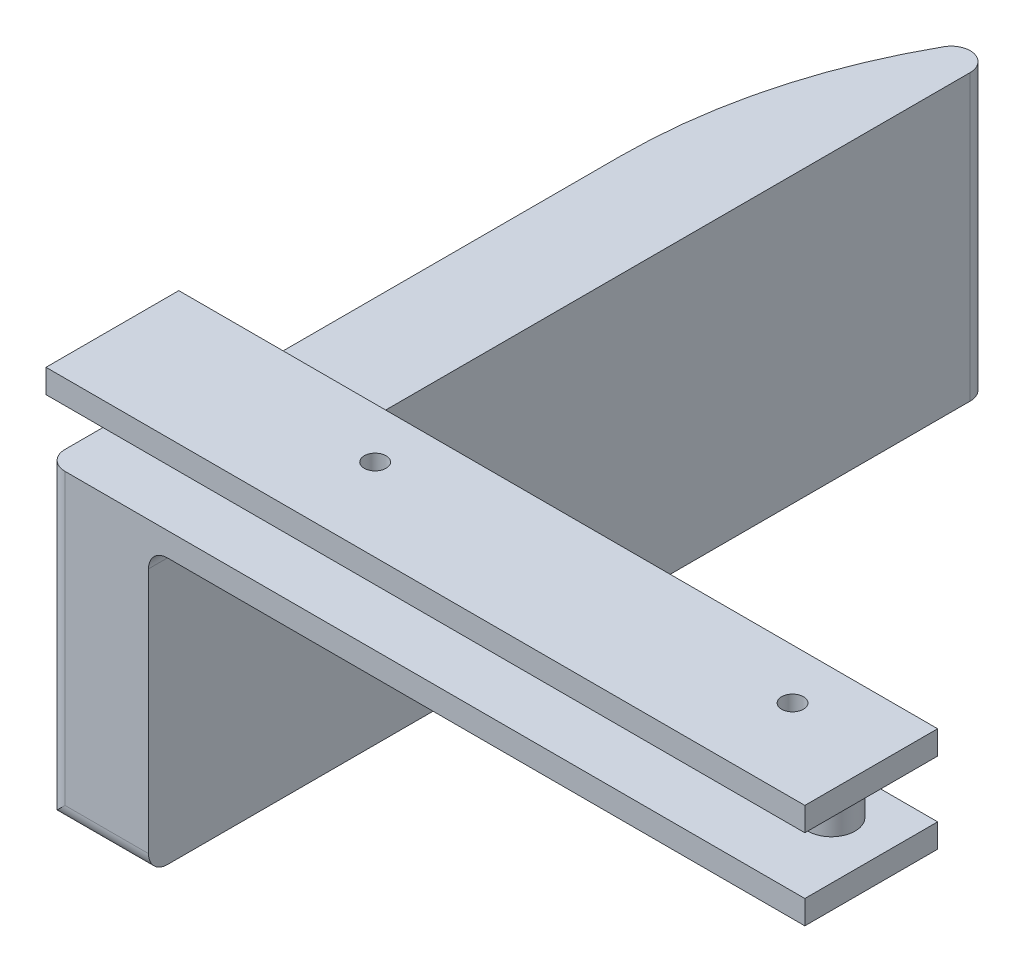
ISO-10303-21;
HEADER;
FILE_DESCRIPTION(('STEP AP214'),'2;1');
FILE_NAME('part.step','',(''),(''),'','','');
FILE_SCHEMA(('AUTOMOTIVE_DESIGN { 1 0 10303 214 1 1 1 1 }'));
ENDSEC;
DATA;
#1=APPLICATION_CONTEXT('core data for automotive mechanical design processes');
#2=APPLICATION_PROTOCOL_DEFINITION('international standard','automotive_design',2000,#1);
#3=PRODUCT_CONTEXT('',#1,'mechanical');
#4=PRODUCT('Part','Part','',(#3));
#5=PRODUCT_RELATED_PRODUCT_CATEGORY('part','',(#4));
#6=PRODUCT_DEFINITION_FORMATION('','',#4);
#7=PRODUCT_DEFINITION_CONTEXT('part definition',#1,'design');
#8=PRODUCT_DEFINITION('design','',#6,#7);
#9=PRODUCT_DEFINITION_SHAPE('','',#8);
#10=(LENGTH_UNIT() NAMED_UNIT(*) SI_UNIT(.MILLI.,.METRE.));
#11=(NAMED_UNIT(*) PLANE_ANGLE_UNIT() SI_UNIT($,.RADIAN.));
#12=(NAMED_UNIT(*) SI_UNIT($,.STERADIAN.) SOLID_ANGLE_UNIT());
#13=UNCERTAINTY_MEASURE_WITH_UNIT(LENGTH_MEASURE(1.E-05),#10,'distance_accuracy_value','');
#14=(GEOMETRIC_REPRESENTATION_CONTEXT(3) GLOBAL_UNCERTAINTY_ASSIGNED_CONTEXT((#13)) GLOBAL_UNIT_ASSIGNED_CONTEXT((#10,
#11,#12)) REPRESENTATION_CONTEXT('',''));
#15=CARTESIAN_POINT('',(0.,0.,0.));
#16=DIRECTION('',(0.,0.,1.));
#17=DIRECTION('',(1.,0.,0.));
#18=AXIS2_PLACEMENT_3D('',#15,#16,#17);
#19=CARTESIAN_POINT('',(0.,-10.795,0.));
#20=DIRECTION('',(0.,1.,0.));
#21=DIRECTION('',(0.,0.,-1.));
#22=AXIS2_PLACEMENT_3D('',#19,#20,#21);
#23=PLANE('',#22);
#24=CARTESIAN_POINT('',(88.9,-10.795,-11.049));
#25=DIRECTION('',(0.,1.,0.));
#26=DIRECTION('',(0.,0.,1.));
#27=AXIS2_PLACEMENT_3D('',#24,#25,#26);
#28=CIRCLE('',#27,1.4605);
#29=CARTESIAN_POINT('',(88.9,-10.795,-9.5885));
#30=VERTEX_POINT('',#29);
#31=EDGE_CURVE('E348',#30,#30,#28,.T.);
#32=ORIENTED_EDGE('',*,*,#31,.T.);
#33=EDGE_LOOP('',(#32));
#34=FACE_BOUND('',#33,.T.);
#35=CARTESIAN_POINT('',(33.02,-10.795,-11.049));
#36=DIRECTION('',(0.,1.,0.));
#37=DIRECTION('',(0.,0.,1.));
#38=AXIS2_PLACEMENT_3D('',#35,#36,#37);
#39=CIRCLE('',#38,1.46050000000001);
#40=CARTESIAN_POINT('',(33.02,-10.795,-9.58849999999999));
#41=VERTEX_POINT('',#40);
#42=EDGE_CURVE('E351',#41,#41,#39,.T.);
#43=ORIENTED_EDGE('',*,*,#42,.T.);
#44=EDGE_LOOP('',(#43));
#45=FACE_BOUND('',#44,.T.);
#46=DIRECTION('',(1.,0.,0.));
#47=VECTOR('',#46,1.);
#48=CARTESIAN_POINT('',(0.,-10.795,0.));
#49=LINE('',#48,#47);
#50=CARTESIAN_POINT('',(16.2644477837442,-10.795,0.));
#51=VERTEX_POINT('',#50);
#52=CARTESIAN_POINT('',(101.6,-10.795,0.));
#53=VERTEX_POINT('',#52);
#54=EDGE_CURVE('E213',#51,#53,#49,.T.);
#55=ORIENTED_EDGE('',*,*,#54,.F.);
#56=DIRECTION('',(0.,0.,1.));
#57=VECTOR('',#56,1.);
#58=CARTESIAN_POINT('',(16.2644477837442,-10.795,-17.78));
#59=LINE('',#58,#57);
#60=CARTESIAN_POINT('',(16.2644477837442,-10.795,-17.78));
#61=VERTEX_POINT('',#60);
#62=EDGE_CURVE('E56',#51,#61,#59,.F.);
#63=ORIENTED_EDGE('',*,*,#62,.T.);
#64=DIRECTION('',(-1.,0.,0.));
#65=VECTOR('',#64,1.);
#66=CARTESIAN_POINT('',(0.,-10.795,-17.78));
#67=LINE('',#66,#65);
#68=CARTESIAN_POINT('',(101.6,-10.795,-17.78));
#69=VERTEX_POINT('',#68);
#70=EDGE_CURVE('E207',#69,#61,#67,.T.);
#71=ORIENTED_EDGE('',*,*,#70,.F.);
#72=DIRECTION('',(0.,0.,-1.));
#73=VECTOR('',#72,1.);
#74=CARTESIAN_POINT('',(101.6,-10.795,0.));
#75=LINE('',#74,#73);
#76=EDGE_CURVE('E209',#53,#69,#75,.T.);
#77=ORIENTED_EDGE('',*,*,#76,.F.);
#78=EDGE_LOOP('',(#55,#63,#71,#77));
#79=FACE_BOUND('',#78,.T.);
#80=ADVANCED_FACE('F33',(#34,#45,#79),#23,.F.);
#81=CARTESIAN_POINT('',(0.,3.175,0.));
#82=DIRECTION('',(1.,0.,0.));
#83=DIRECTION('',(0.,0.,-1.));
#84=AXIS2_PLACEMENT_3D('',#81,#82,#83);
#85=PLANE('',#84);
#86=DIRECTION('',(0.,0.,1.));
#87=VECTOR('',#86,1.);
#88=CARTESIAN_POINT('',(0.,0.,0.));
#89=LINE('',#88,#87);
#90=CARTESIAN_POINT('',(0.,0.,-17.78));
#91=VERTEX_POINT('',#90);
#92=CARTESIAN_POINT('',(0.,0.,0.));
#93=VERTEX_POINT('',#92);
#94=EDGE_CURVE('E261',#91,#93,#89,.T.);
#95=ORIENTED_EDGE('',*,*,#94,.T.);
#96=DIRECTION('',(0.,-1.,0.));
#97=VECTOR('',#96,1.);
#98=CARTESIAN_POINT('',(0.,3.175,0.));
#99=LINE('',#98,#97);
#100=CARTESIAN_POINT('',(0.,3.175,0.));
#101=VERTEX_POINT('',#100);
#102=EDGE_CURVE('E288',#101,#93,#99,.T.);
#103=ORIENTED_EDGE('',*,*,#102,.F.);
#104=DIRECTION('',(0.,0.,1.));
#105=VECTOR('',#104,1.);
#106=CARTESIAN_POINT('',(0.,3.175,0.));
#107=LINE('',#106,#105);
#108=CARTESIAN_POINT('',(0.,3.175,-17.78));
#109=VERTEX_POINT('',#108);
#110=EDGE_CURVE('E262',#109,#101,#107,.T.);
#111=ORIENTED_EDGE('',*,*,#110,.F.);
#112=DIRECTION('',(0.,-1.,0.));
#113=VECTOR('',#112,1.);
#114=CARTESIAN_POINT('',(0.,3.175,-17.78));
#115=LINE('',#114,#113);
#116=EDGE_CURVE('E272',#109,#91,#115,.T.);
#117=ORIENTED_EDGE('',*,*,#116,.T.);
#118=EDGE_LOOP('',(#95,#103,#111,#117));
#119=FACE_BOUND('',#118,.T.);
#120=ADVANCED_FACE('F373',(#119),#85,.F.);
#121=CARTESIAN_POINT('',(0.,3.175,0.));
#122=DIRECTION('',(0.,0.,-1.));
#123=DIRECTION('',(-1.,0.,0.));
#124=AXIS2_PLACEMENT_3D('',#121,#122,#123);
#125=PLANE('',#124);
#126=DIRECTION('',(1.,0.,0.));
#127=VECTOR('',#126,1.);
#128=CARTESIAN_POINT('',(0.,0.,0.));
#129=LINE('',#128,#127);
#130=CARTESIAN_POINT('',(101.6,0.,0.));
#131=VERTEX_POINT('',#130);
#132=EDGE_CURVE('E275',#93,#131,#129,.T.);
#133=ORIENTED_EDGE('',*,*,#132,.T.);
#134=DIRECTION('',(0.,-1.,0.));
#135=VECTOR('',#134,1.);
#136=CARTESIAN_POINT('',(101.6,3.175,0.));
#137=LINE('',#136,#135);
#138=CARTESIAN_POINT('',(101.6,3.175,0.));
#139=VERTEX_POINT('',#138);
#140=EDGE_CURVE('E285',#139,#131,#137,.T.);
#141=ORIENTED_EDGE('',*,*,#140,.F.);
#142=DIRECTION('',(1.,0.,0.));
#143=VECTOR('',#142,1.);
#144=CARTESIAN_POINT('',(0.,3.175,0.));
#145=LINE('',#144,#143);
#146=EDGE_CURVE('E265',#101,#139,#145,.T.);
#147=ORIENTED_EDGE('',*,*,#146,.F.);
#148=ORIENTED_EDGE('',*,*,#102,.T.);
#149=EDGE_LOOP('',(#133,#141,#147,#148));
#150=FACE_BOUND('',#149,.T.);
#151=ADVANCED_FACE('F378',(#150),#125,.F.);
#152=CARTESIAN_POINT('',(101.6,3.175,0.));
#153=DIRECTION('',(-1.,0.,0.));
#154=DIRECTION('',(0.,0.,1.));
#155=AXIS2_PLACEMENT_3D('',#152,#153,#154);
#156=PLANE('',#155);
#157=DIRECTION('',(0.,0.,-1.));
#158=VECTOR('',#157,1.);
#159=CARTESIAN_POINT('',(101.6,0.,0.));
#160=LINE('',#159,#158);
#161=CARTESIAN_POINT('',(101.6,0.,-17.78));
#162=VERTEX_POINT('',#161);
#163=EDGE_CURVE('E277',#131,#162,#160,.T.);
#164=ORIENTED_EDGE('',*,*,#163,.T.);
#165=DIRECTION('',(0.,-1.,0.));
#166=VECTOR('',#165,1.);
#167=CARTESIAN_POINT('',(101.6,3.175,-17.78));
#168=LINE('',#167,#166);
#169=CARTESIAN_POINT('',(101.6,3.175,-17.78));
#170=VERTEX_POINT('',#169);
#171=EDGE_CURVE('E282',#170,#162,#168,.T.);
#172=ORIENTED_EDGE('',*,*,#171,.F.);
#173=DIRECTION('',(0.,0.,-1.));
#174=VECTOR('',#173,1.);
#175=CARTESIAN_POINT('',(101.6,3.175,0.));
#176=LINE('',#175,#174);
#177=EDGE_CURVE('E268',#139,#170,#176,.T.);
#178=ORIENTED_EDGE('',*,*,#177,.F.);
#179=ORIENTED_EDGE('',*,*,#140,.T.);
#180=EDGE_LOOP('',(#164,#172,#178,#179));
#181=FACE_BOUND('',#180,.T.);
#182=ADVANCED_FACE('F423',(#181),#156,.F.);
#183=CARTESIAN_POINT('',(0.,3.175,-17.78));
#184=DIRECTION('',(0.,0.,1.));
#185=DIRECTION('',(1.,0.,0.));
#186=AXIS2_PLACEMENT_3D('',#183,#184,#185);
#187=PLANE('',#186);
#188=DIRECTION('',(-1.,0.,0.));
#189=VECTOR('',#188,1.);
#190=CARTESIAN_POINT('',(0.,0.,-17.78));
#191=LINE('',#190,#189);
#192=EDGE_CURVE('E266',#162,#91,#191,.T.);
#193=ORIENTED_EDGE('',*,*,#192,.T.);
#194=ORIENTED_EDGE('',*,*,#116,.F.);
#195=DIRECTION('',(-1.,0.,0.));
#196=VECTOR('',#195,1.);
#197=CARTESIAN_POINT('',(0.,3.175,-17.78));
#198=LINE('',#197,#196);
#199=EDGE_CURVE('E270',#170,#109,#198,.T.);
#200=ORIENTED_EDGE('',*,*,#199,.F.);
#201=ORIENTED_EDGE('',*,*,#171,.T.);
#202=EDGE_LOOP('',(#193,#194,#200,#201));
#203=FACE_BOUND('',#202,.T.);
#204=ADVANCED_FACE('F416',(#203),#187,.F.);
#205=CARTESIAN_POINT('',(0.,3.175,0.));
#206=DIRECTION('',(0.,-1.,0.));
#207=DIRECTION('',(0.,0.,-1.));
#208=AXIS2_PLACEMENT_3D('',#205,#206,#207);
#209=PLANE('',#208);
#210=CARTESIAN_POINT('',(88.9,3.175,-11.049));
#211=DIRECTION('',(0.,1.,0.));
#212=DIRECTION('',(0.,0.,1.));
#213=AXIS2_PLACEMENT_3D('',#210,#211,#212);
#214=CIRCLE('',#213,1.4605);
#215=CARTESIAN_POINT('',(88.9,3.175,-9.5885));
#216=VERTEX_POINT('',#215);
#217=EDGE_CURVE('E356',#216,#216,#214,.T.);
#218=ORIENTED_EDGE('',*,*,#217,.F.);
#219=EDGE_LOOP('',(#218));
#220=FACE_BOUND('',#219,.T.);
#221=CARTESIAN_POINT('',(33.02,3.175,-11.049));
#222=DIRECTION('',(0.,1.,0.));
#223=DIRECTION('',(0.,0.,1.));
#224=AXIS2_PLACEMENT_3D('',#221,#222,#223);
#225=CIRCLE('',#224,1.46050000000001);
#226=CARTESIAN_POINT('',(33.02,3.175,-9.58849999999999));
#227=VERTEX_POINT('',#226);
#228=EDGE_CURVE('E570',#227,#227,#225,.T.);
#229=ORIENTED_EDGE('',*,*,#228,.F.);
#230=EDGE_LOOP('',(#229));
#231=FACE_BOUND('',#230,.T.);
#232=ORIENTED_EDGE('',*,*,#110,.T.);
#233=ORIENTED_EDGE('',*,*,#146,.T.);
#234=ORIENTED_EDGE('',*,*,#177,.T.);
#235=ORIENTED_EDGE('',*,*,#199,.T.);
#236=EDGE_LOOP('',(#232,#233,#234,#235));
#237=FACE_BOUND('',#236,.T.);
#238=ADVANCED_FACE('F413',(#220,#231,#237),#209,.F.);
#239=CARTESIAN_POINT('',(0.,0.,0.));
#240=DIRECTION('',(0.,-1.,0.));
#241=DIRECTION('',(0.,0.,-1.));
#242=AXIS2_PLACEMENT_3D('',#239,#240,#241);
#243=PLANE('',#242);
#244=CARTESIAN_POINT('',(93.98,0.,-11.176));
#245=DIRECTION('',(0.,-1.,0.));
#246=DIRECTION('',(0.,0.,-1.));
#247=AXIS2_PLACEMENT_3D('',#244,#245,#246);
#248=CIRCLE('',#247,3.175);
#249=CARTESIAN_POINT('',(93.98,0.,-14.351));
#250=VERTEX_POINT('',#249);
#251=CARTESIAN_POINT('',(93.98,0.,-8.00099999999999));
#252=VERTEX_POINT('',#251);
#253=EDGE_CURVE('E229',#250,#252,#248,.T.);
#254=ORIENTED_EDGE('',*,*,#253,.F.);
#255=DIRECTION('',(-1.,0.,0.));
#256=VECTOR('',#255,1.);
#257=CARTESIAN_POINT('',(93.98,0.,-14.351));
#258=LINE('',#257,#256);
#259=CARTESIAN_POINT('',(5.08,0.,-14.351));
#260=VERTEX_POINT('',#259);
#261=EDGE_CURVE('E233',#250,#260,#258,.T.);
#262=ORIENTED_EDGE('',*,*,#261,.T.);
#263=CARTESIAN_POINT('',(5.08,0.,-11.176));
#264=DIRECTION('',(0.,-1.,0.));
#265=DIRECTION('',(0.,0.,-1.));
#266=AXIS2_PLACEMENT_3D('',#263,#264,#265);
#267=CIRCLE('',#266,3.175);
#268=CARTESIAN_POINT('',(5.08,0.,-8.001));
#269=VERTEX_POINT('',#268);
#270=EDGE_CURVE('E246',#269,#260,#267,.T.);
#271=ORIENTED_EDGE('',*,*,#270,.F.);
#272=DIRECTION('',(-1.,0.,0.));
#273=VECTOR('',#272,1.);
#274=CARTESIAN_POINT('',(93.98,0.,-8.00099999999999));
#275=LINE('',#274,#273);
#276=EDGE_CURVE('E243',#252,#269,#275,.T.);
#277=ORIENTED_EDGE('',*,*,#276,.F.);
#278=EDGE_LOOP('',(#254,#262,#271,#277));
#279=FACE_BOUND('',#278,.T.);
#280=ORIENTED_EDGE('',*,*,#94,.F.);
#281=ORIENTED_EDGE('',*,*,#192,.F.);
#282=ORIENTED_EDGE('',*,*,#163,.F.);
#283=ORIENTED_EDGE('',*,*,#132,.F.);
#284=EDGE_LOOP('',(#280,#281,#282,#283));
#285=FACE_BOUND('',#284,.T.);
#286=ADVANCED_FACE('F411',(#279,#285),#243,.T.);
#287=CARTESIAN_POINT('',(93.98,-7.62,-11.176));
#288=DIRECTION('',(0.,1.,0.));
#289=DIRECTION('',(0.,0.,1.));
#290=AXIS2_PLACEMENT_3D('',#287,#288,#289);
#291=CYLINDRICAL_SURFACE('',#290,3.175);
#292=ORIENTED_EDGE('',*,*,#253,.T.);
#293=DIRECTION('',(0.,1.,0.));
#294=VECTOR('',#293,1.);
#295=CARTESIAN_POINT('',(93.98,-7.62,-8.00099999999999));
#296=LINE('',#295,#294);
#297=CARTESIAN_POINT('',(93.98,-7.62,-8.00099999999999));
#298=VERTEX_POINT('',#297);
#299=EDGE_CURVE('E258',#298,#252,#296,.T.);
#300=ORIENTED_EDGE('',*,*,#299,.F.);
#301=CARTESIAN_POINT('',(93.98,-7.62,-11.176));
#302=DIRECTION('',(0.,-1.,0.));
#303=DIRECTION('',(0.,0.,-1.));
#304=AXIS2_PLACEMENT_3D('',#301,#302,#303);
#305=CIRCLE('',#304,3.175);
#306=CARTESIAN_POINT('',(93.98,-7.62,-14.351));
#307=VERTEX_POINT('',#306);
#308=EDGE_CURVE('E230',#307,#298,#305,.T.);
#309=ORIENTED_EDGE('',*,*,#308,.F.);
#310=DIRECTION('',(0.,1.,0.));
#311=VECTOR('',#310,1.);
#312=CARTESIAN_POINT('',(93.98,-7.62,-14.351));
#313=LINE('',#312,#311);
#314=EDGE_CURVE('E240',#307,#250,#313,.T.);
#315=ORIENTED_EDGE('',*,*,#314,.T.);
#316=EDGE_LOOP('',(#292,#300,#309,#315));
#317=FACE_BOUND('',#316,.T.);
#318=ADVANCED_FACE('F407',(#317),#291,.T.);
#319=CARTESIAN_POINT('',(93.98,-7.62,-8.00099999999999));
#320=DIRECTION('',(0.,0.,-1.));
#321=DIRECTION('',(-1.,0.,0.));
#322=AXIS2_PLACEMENT_3D('',#319,#320,#321);
#323=PLANE('',#322);
#324=ORIENTED_EDGE('',*,*,#276,.T.);
#325=DIRECTION('',(0.,1.,0.));
#326=VECTOR('',#325,1.);
#327=CARTESIAN_POINT('',(5.08,-7.62,-8.001));
#328=LINE('',#327,#326);
#329=CARTESIAN_POINT('',(5.08,-7.62,-8.001));
#330=VERTEX_POINT('',#329);
#331=EDGE_CURVE('E255',#330,#269,#328,.T.);
#332=ORIENTED_EDGE('',*,*,#331,.F.);
#333=DIRECTION('',(-1.,0.,0.));
#334=VECTOR('',#333,1.);
#335=CARTESIAN_POINT('',(93.98,-7.62,-8.00099999999999));
#336=LINE('',#335,#334);
#337=EDGE_CURVE('E232',#298,#330,#336,.T.);
#338=ORIENTED_EDGE('',*,*,#337,.F.);
#339=ORIENTED_EDGE('',*,*,#299,.T.);
#340=EDGE_LOOP('',(#324,#332,#338,#339));
#341=FACE_BOUND('',#340,.T.);
#342=ADVANCED_FACE('F403',(#341),#323,.F.);
#343=CARTESIAN_POINT('',(5.08,-7.62,-11.176));
#344=DIRECTION('',(0.,1.,0.));
#345=DIRECTION('',(0.,0.,1.));
#346=AXIS2_PLACEMENT_3D('',#343,#344,#345);
#347=CYLINDRICAL_SURFACE('',#346,3.175);
#348=ORIENTED_EDGE('',*,*,#270,.T.);
#349=DIRECTION('',(0.,1.,0.));
#350=VECTOR('',#349,1.);
#351=CARTESIAN_POINT('',(5.08,-7.62,-14.351));
#352=LINE('',#351,#350);
#353=CARTESIAN_POINT('',(5.08,-7.62,-14.351));
#354=VERTEX_POINT('',#353);
#355=EDGE_CURVE('E252',#354,#260,#352,.T.);
#356=ORIENTED_EDGE('',*,*,#355,.F.);
#357=CARTESIAN_POINT('',(5.08,-7.62,-11.176));
#358=DIRECTION('',(0.,-1.,0.));
#359=DIRECTION('',(0.,0.,-1.));
#360=AXIS2_PLACEMENT_3D('',#357,#358,#359);
#361=CIRCLE('',#360,3.175);
#362=EDGE_CURVE('E235',#330,#354,#361,.T.);
#363=ORIENTED_EDGE('',*,*,#362,.F.);
#364=ORIENTED_EDGE('',*,*,#331,.T.);
#365=EDGE_LOOP('',(#348,#356,#363,#364));
#366=FACE_BOUND('',#365,.T.);
#367=ADVANCED_FACE('F399',(#366),#347,.T.);
#368=CARTESIAN_POINT('',(93.98,-7.62,-14.351));
#369=DIRECTION('',(0.,0.,-1.));
#370=DIRECTION('',(-1.,0.,0.));
#371=AXIS2_PLACEMENT_3D('',#368,#369,#370);
#372=PLANE('',#371);
#373=ORIENTED_EDGE('',*,*,#261,.F.);
#374=ORIENTED_EDGE('',*,*,#314,.F.);
#375=DIRECTION('',(-1.,0.,0.));
#376=VECTOR('',#375,1.);
#377=CARTESIAN_POINT('',(93.98,-7.62,-14.351));
#378=LINE('',#377,#376);
#379=EDGE_CURVE('E237',#307,#354,#378,.T.);
#380=ORIENTED_EDGE('',*,*,#379,.T.);
#381=ORIENTED_EDGE('',*,*,#355,.T.);
#382=EDGE_LOOP('',(#373,#374,#380,#381));
#383=FACE_BOUND('',#382,.T.);
#384=ADVANCED_FACE('F396',(#383),#372,.T.);
#385=CARTESIAN_POINT('',(0.,-10.795,0.));
#386=DIRECTION('',(-1.,0.,0.));
#387=DIRECTION('',(0.,0.,1.));
#388=AXIS2_PLACEMENT_3D('',#385,#386,#387);
#389=PLANE('',#388);
#390=DIRECTION('',(0.,0.,-1.));
#391=VECTOR('',#390,1.);
#392=CARTESIAN_POINT('',(0.,-48.895,0.));
#393=LINE('',#392,#391);
#394=CARTESIAN_POINT('',(0.,-48.895,-2.54));
#395=VERTEX_POINT('',#394);
#396=CARTESIAN_POINT('',(0.,-48.895,-76.9173177660465));
#397=VERTEX_POINT('',#396);
#398=EDGE_CURVE('E169',#395,#397,#393,.T.);
#399=ORIENTED_EDGE('',*,*,#398,.F.);
#400=DIRECTION('',(0.,1.,0.));
#401=VECTOR('',#400,1.);
#402=CARTESIAN_POINT('',(0.,-10.795,-2.54));
#403=LINE('',#402,#401);
#404=CARTESIAN_POINT('',(0.,-7.62,-2.54));
#405=VERTEX_POINT('',#404);
#406=EDGE_CURVE('E299',#395,#405,#403,.T.);
#407=ORIENTED_EDGE('',*,*,#406,.T.);
#408=DIRECTION('',(0.,0.,1.));
#409=VECTOR('',#408,1.);
#410=CARTESIAN_POINT('',(0.,-7.62,0.));
#411=LINE('',#410,#409);
#412=CARTESIAN_POINT('',(0.,-7.62,-17.78));
#413=VERTEX_POINT('',#412);
#414=EDGE_CURVE('E197',#413,#405,#411,.T.);
#415=ORIENTED_EDGE('',*,*,#414,.F.);
#416=DIRECTION('',(0.,1.,0.));
#417=VECTOR('',#416,1.);
#418=CARTESIAN_POINT('',(0.,-10.795,-17.78));
#419=LINE('',#418,#417);
#420=CARTESIAN_POINT('',(0.,-10.795,-17.78));
#421=VERTEX_POINT('',#420);
#422=EDGE_CURVE('E227',#421,#413,#419,.T.);
#423=ORIENTED_EDGE('',*,*,#422,.F.);
#424=DIRECTION('',(0.,0.,-1.));
#425=VECTOR('',#424,1.);
#426=CARTESIAN_POINT('',(0.,-10.795,0.));
#427=LINE('',#426,#425);
#428=CARTESIAN_POINT('',(0.,-10.795,-76.9173177660465));
#429=VERTEX_POINT('',#428);
#430=EDGE_CURVE('E195',#421,#429,#427,.T.);
#431=ORIENTED_EDGE('',*,*,#430,.T.);
#432=DIRECTION('',(0.,1.,0.));
#433=VECTOR('',#432,1.);
#434=CARTESIAN_POINT('',(0.,-48.895,-76.9173177660465));
#435=LINE('',#434,#433);
#436=EDGE_CURVE('E187',#397,#429,#435,.T.);
#437=ORIENTED_EDGE('',*,*,#436,.F.);
#438=EDGE_LOOP('',(#399,#407,#415,#423,#431,#437));
#439=FACE_BOUND('',#438,.T.);
#440=ADVANCED_FACE('F192',(#439),#389,.T.);
#441=CARTESIAN_POINT('',(0.,-10.795,-17.78));
#442=DIRECTION('',(0.,0.,-1.));
#443=DIRECTION('',(-1.,0.,0.));
#444=AXIS2_PLACEMENT_3D('',#441,#442,#443);
#445=PLANE('',#444);
#446=DIRECTION('',(-1.,0.,0.));
#447=VECTOR('',#446,1.);
#448=CARTESIAN_POINT('',(0.,-7.62,-17.78));
#449=LINE('',#448,#447);
#450=CARTESIAN_POINT('',(101.6,-7.62,-17.78));
#451=VERTEX_POINT('',#450);
#452=EDGE_CURVE('E201',#451,#413,#449,.T.);
#453=ORIENTED_EDGE('',*,*,#452,.F.);
#454=DIRECTION('',(0.,1.,0.));
#455=VECTOR('',#454,1.);
#456=CARTESIAN_POINT('',(101.6,-10.795,-17.78));
#457=LINE('',#456,#455);
#458=EDGE_CURVE('E225',#69,#451,#457,.T.);
#459=ORIENTED_EDGE('',*,*,#458,.F.);
#460=ORIENTED_EDGE('',*,*,#70,.T.);
#461=CARTESIAN_POINT('',(16.2644477837442,-13.335,-17.78));
#462=DIRECTION('',(0.,0.,-1.));
#463=DIRECTION('',(-1.,0.,0.));
#464=AXIS2_PLACEMENT_3D('',#461,#462,#463);
#465=CIRCLE('',#464,2.54);
#466=CARTESIAN_POINT('',(13.7244477837442,-13.335,-17.78));
#467=VERTEX_POINT('',#466);
#468=EDGE_CURVE('E11',#61,#467,#465,.F.);
#469=ORIENTED_EDGE('',*,*,#468,.T.);
#470=DIRECTION('',(0.,-1.,0.));
#471=VECTOR('',#470,1.);
#472=CARTESIAN_POINT('',(13.7244477837442,-48.895,-17.78));
#473=LINE('',#472,#471);
#474=CARTESIAN_POINT('',(13.7244477837442,-10.795,-17.78));
#475=VERTEX_POINT('',#474);
#476=EDGE_CURVE('E48',#475,#467,#473,.T.);
#477=ORIENTED_EDGE('',*,*,#476,.F.);
#478=EDGE_CURVE('E210',#475,#421,#67,.T.);
#479=ORIENTED_EDGE('',*,*,#478,.T.);
#480=ORIENTED_EDGE('',*,*,#422,.T.);
#481=EDGE_LOOP('',(#453,#459,#460,#469,#477,#479,#480));
#482=FACE_BOUND('',#481,.T.);
#483=ADVANCED_FACE('F325',(#482),#445,.T.);
#484=CARTESIAN_POINT('',(101.6,-10.795,0.));
#485=DIRECTION('',(1.,0.,0.));
#486=DIRECTION('',(0.,0.,-1.));
#487=AXIS2_PLACEMENT_3D('',#484,#485,#486);
#488=PLANE('',#487);
#489=DIRECTION('',(0.,0.,-1.));
#490=VECTOR('',#489,1.);
#491=CARTESIAN_POINT('',(101.6,-7.62,0.));
#492=LINE('',#491,#490);
#493=CARTESIAN_POINT('',(101.6,-7.62,0.));
#494=VERTEX_POINT('',#493);
#495=EDGE_CURVE('E218',#494,#451,#492,.T.);
#496=ORIENTED_EDGE('',*,*,#495,.F.);
#497=DIRECTION('',(0.,1.,0.));
#498=VECTOR('',#497,1.);
#499=CARTESIAN_POINT('',(101.6,-10.795,0.));
#500=LINE('',#499,#498);
#501=EDGE_CURVE('E214',#53,#494,#500,.T.);
#502=ORIENTED_EDGE('',*,*,#501,.F.);
#503=ORIENTED_EDGE('',*,*,#76,.T.);
#504=ORIENTED_EDGE('',*,*,#458,.T.);
#505=EDGE_LOOP('',(#496,#502,#503,#504));
#506=FACE_BOUND('',#505,.T.);
#507=ADVANCED_FACE('F341',(#506),#488,.T.);
#508=CARTESIAN_POINT('',(0.,-10.795,0.));
#509=DIRECTION('',(0.,0.,1.));
#510=DIRECTION('',(1.,0.,0.));
#511=AXIS2_PLACEMENT_3D('',#508,#509,#510);
#512=PLANE('',#511);
#513=DIRECTION('',(1.,0.,0.));
#514=VECTOR('',#513,1.);
#515=CARTESIAN_POINT('',(0.,-7.62,0.));
#516=LINE('',#515,#514);
#517=CARTESIAN_POINT('',(2.54,-7.62,0.));
#518=VERTEX_POINT('',#517);
#519=EDGE_CURVE('E221',#518,#494,#516,.T.);
#520=ORIENTED_EDGE('',*,*,#519,.F.);
#521=DIRECTION('',(0.,1.,0.));
#522=VECTOR('',#521,1.);
#523=CARTESIAN_POINT('',(2.54,-10.795,0.));
#524=LINE('',#523,#522);
#525=CARTESIAN_POINT('',(2.54,-46.355,0.));
#526=VERTEX_POINT('',#525);
#527=EDGE_CURVE('E305',#518,#526,#524,.F.);
#528=ORIENTED_EDGE('',*,*,#527,.T.);
#529=DIRECTION('',(-1.,0.,0.));
#530=VECTOR('',#529,1.);
#531=CARTESIAN_POINT('',(0.,-46.355,0.));
#532=LINE('',#531,#530);
#533=CARTESIAN_POINT('',(13.7244477837442,-46.355,0.));
#534=VERTEX_POINT('',#533);
#535=EDGE_CURVE('E303',#526,#534,#532,.F.);
#536=ORIENTED_EDGE('',*,*,#535,.T.);
#537=DIRECTION('',(0.,1.,0.));
#538=VECTOR('',#537,1.);
#539=CARTESIAN_POINT('',(13.7244477837442,-48.895,0.));
#540=LINE('',#539,#538);
#541=CARTESIAN_POINT('',(13.7244477837442,-13.335,0.));
#542=VERTEX_POINT('',#541);
#543=EDGE_CURVE('E198',#534,#542,#540,.T.);
#544=ORIENTED_EDGE('',*,*,#543,.T.);
#545=CARTESIAN_POINT('',(16.2644477837442,-13.335,0.));
#546=DIRECTION('',(0.,0.,1.));
#547=DIRECTION('',(1.,0.,0.));
#548=AXIS2_PLACEMENT_3D('',#545,#546,#547);
#549=CIRCLE('',#548,2.54);
#550=EDGE_CURVE('E42',#542,#51,#549,.F.);
#551=ORIENTED_EDGE('',*,*,#550,.T.);
#552=ORIENTED_EDGE('',*,*,#54,.T.);
#553=ORIENTED_EDGE('',*,*,#501,.T.);
#554=EDGE_LOOP('',(#520,#528,#536,#544,#551,#552,#553));
#555=FACE_BOUND('',#554,.T.);
#556=ADVANCED_FACE('F317',(#555),#512,.T.);
#557=CARTESIAN_POINT('',(0.,-7.62,0.));
#558=DIRECTION('',(0.,1.,0.));
#559=DIRECTION('',(0.,0.,-1.));
#560=AXIS2_PLACEMENT_3D('',#557,#558,#559);
#561=PLANE('',#560);
#562=ORIENTED_EDGE('',*,*,#379,.F.);
#563=ORIENTED_EDGE('',*,*,#308,.T.);
#564=ORIENTED_EDGE('',*,*,#337,.T.);
#565=ORIENTED_EDGE('',*,*,#362,.T.);
#566=EDGE_LOOP('',(#562,#563,#564,#565));
#567=FACE_BOUND('',#566,.T.);
#568=ORIENTED_EDGE('',*,*,#414,.T.);
#569=CARTESIAN_POINT('',(2.54,-7.62,-2.54));
#570=DIRECTION('',(0.,1.,0.));
#571=DIRECTION('',(0.,0.,1.));
#572=AXIS2_PLACEMENT_3D('',#569,#570,#571);
#573=CIRCLE('',#572,2.54);
#574=EDGE_CURVE('E301',#405,#518,#573,.T.);
#575=ORIENTED_EDGE('',*,*,#574,.T.);
#576=ORIENTED_EDGE('',*,*,#519,.T.);
#577=ORIENTED_EDGE('',*,*,#495,.T.);
#578=ORIENTED_EDGE('',*,*,#452,.T.);
#579=EDGE_LOOP('',(#568,#575,#576,#577,#578));
#580=FACE_BOUND('',#579,.T.);
#581=ADVANCED_FACE('F338',(#567,#580),#561,.T.);
#582=CARTESIAN_POINT('',(70.2143866228511,-48.895,-76.9173177660465));
#583=DIRECTION('',(0.,1.,0.));
#584=DIRECTION('',(0.,0.,1.));
#585=AXIS2_PLACEMENT_3D('',#582,#583,#584);
#586=CYLINDRICAL_SURFACE('',#585,70.2143866228511);
#587=CARTESIAN_POINT('',(70.2143866228511,-10.795,-76.9173177660465));
#588=DIRECTION('',(0.,-1.,0.));
#589=DIRECTION('',(0.,0.,-1.));
#590=AXIS2_PLACEMENT_3D('',#587,#588,#589);
#591=CIRCLE('',#590,70.2143866228511);
#592=CARTESIAN_POINT('',(8.96889693602206,-10.795,-111.254616463581));
#593=VERTEX_POINT('',#592);
#594=EDGE_CURVE('E333',#429,#593,#591,.T.);
#595=ORIENTED_EDGE('',*,*,#594,.T.);
#596=DIRECTION('',(0.,1.,0.));
#597=VECTOR('',#596,1.);
#598=CARTESIAN_POINT('',(8.96889693602206,-48.895,-111.254616463581));
#599=LINE('',#598,#597);
#600=CARTESIAN_POINT('',(8.96889693602206,-48.895,-111.254616463581));
#601=VERTEX_POINT('',#600);
#602=EDGE_CURVE('E189',#593,#601,#599,.F.);
#603=ORIENTED_EDGE('',*,*,#602,.T.);
#604=CARTESIAN_POINT('',(70.2143866228511,-48.895,-76.9173177660465));
#605=DIRECTION('',(0.,-1.,0.));
#606=DIRECTION('',(0.,0.,-1.));
#607=AXIS2_PLACEMENT_3D('',#604,#605,#606);
#608=CIRCLE('',#607,70.2143866228511);
#609=EDGE_CURVE('E173',#397,#601,#608,.T.);
#610=ORIENTED_EDGE('',*,*,#609,.F.);
#611=ORIENTED_EDGE('',*,*,#436,.T.);
#612=EDGE_LOOP('',(#595,#603,#610,#611));
#613=FACE_BOUND('',#612,.T.);
#614=ADVANCED_FACE('F186',(#613),#586,.T.);
#615=CARTESIAN_POINT('',(13.7244477837442,-48.895,0.));
#616=DIRECTION('',(-1.,0.,0.));
#617=DIRECTION('',(0.,0.,1.));
#618=AXIS2_PLACEMENT_3D('',#615,#616,#617);
#619=PLANE('',#618);
#620=ORIENTED_EDGE('',*,*,#543,.F.);
#621=CARTESIAN_POINT('',(13.7244477837442,-46.355,-2.54));
#622=DIRECTION('',(-1.,0.,0.));
#623=DIRECTION('',(0.,0.,1.));
#624=AXIS2_PLACEMENT_3D('',#621,#622,#623);
#625=CIRCLE('',#624,2.54);
#626=CARTESIAN_POINT('',(13.7244477837442,-48.895,-2.54));
#627=VERTEX_POINT('',#626);
#628=EDGE_CURVE('E312',#534,#627,#625,.F.);
#629=ORIENTED_EDGE('',*,*,#628,.T.);
#630=DIRECTION('',(0.,0.,1.));
#631=VECTOR('',#630,1.);
#632=CARTESIAN_POINT('',(13.7244477837442,-48.895,0.));
#633=LINE('',#632,#631);
#634=CARTESIAN_POINT('',(13.7244477837442,-48.895,-110.012467341633));
#635=VERTEX_POINT('',#634);
#636=EDGE_CURVE('E190',#635,#627,#633,.T.);
#637=ORIENTED_EDGE('',*,*,#636,.F.);
#638=DIRECTION('',(0.,1.,0.));
#639=VECTOR('',#638,1.);
#640=CARTESIAN_POINT('',(13.7244477837442,-48.895,-110.012467341633));
#641=LINE('',#640,#639);
#642=CARTESIAN_POINT('',(13.7244477837442,-10.795,-110.012467341633));
#643=VERTEX_POINT('',#642);
#644=EDGE_CURVE('E291',#635,#643,#641,.T.);
#645=ORIENTED_EDGE('',*,*,#644,.T.);
#646=DIRECTION('',(0.,0.,1.));
#647=VECTOR('',#646,1.);
#648=CARTESIAN_POINT('',(13.7244477837442,-10.795,0.));
#649=LINE('',#648,#647);
#650=EDGE_CURVE('E181',#643,#475,#649,.T.);
#651=ORIENTED_EDGE('',*,*,#650,.T.);
#652=ORIENTED_EDGE('',*,*,#476,.T.);
#653=DIRECTION('',(0.,0.,1.));
#654=VECTOR('',#653,1.);
#655=CARTESIAN_POINT('',(13.7244477837442,-13.335,0.));
#656=LINE('',#655,#654);
#657=EDGE_CURVE('E309',#467,#542,#656,.T.);
#658=ORIENTED_EDGE('',*,*,#657,.T.);
#659=EDGE_LOOP('',(#620,#629,#637,#645,#651,#652,#658));
#660=FACE_BOUND('',#659,.T.);
#661=ADVANCED_FACE('F327',(#660),#619,.F.);
#662=CARTESIAN_POINT('',(70.2143866228511,-48.895,-76.9173177660465));
#663=DIRECTION('',(0.,-1.,0.));
#664=DIRECTION('',(0.,0.,-1.));
#665=AXIS2_PLACEMENT_3D('',#662,#663,#664);
#666=PLANE('',#665);
#667=ORIENTED_EDGE('',*,*,#636,.T.);
#668=DIRECTION('',(-1.,0.,0.));
#669=VECTOR('',#668,1.);
#670=CARTESIAN_POINT('',(70.2143866228511,-48.895,-2.54));
#671=LINE('',#670,#669);
#672=EDGE_CURVE('E176',#627,#395,#671,.T.);
#673=ORIENTED_EDGE('',*,*,#672,.T.);
#674=ORIENTED_EDGE('',*,*,#398,.T.);
#675=ORIENTED_EDGE('',*,*,#609,.T.);
#676=CARTESIAN_POINT('',(11.1844477837442,-48.895,-110.012467341633));
#677=DIRECTION('',(0.,-1.,0.));
#678=DIRECTION('',(0.,0.,-1.));
#679=AXIS2_PLACEMENT_3D('',#676,#677,#678);
#680=CIRCLE('',#679,2.54);
#681=EDGE_CURVE('E297',#601,#635,#680,.T.);
#682=ORIENTED_EDGE('',*,*,#681,.T.);
#683=EDGE_LOOP('',(#667,#673,#674,#675,#682));
#684=FACE_BOUND('',#683,.T.);
#685=ADVANCED_FACE('F172',(#684),#666,.T.);
#686=CARTESIAN_POINT('',(70.2143866228511,-10.795,-76.9173177660465));
#687=DIRECTION('',(0.,-1.,0.));
#688=DIRECTION('',(0.,0.,-1.));
#689=AXIS2_PLACEMENT_3D('',#686,#687,#688);
#690=PLANE('',#689);
#691=ORIENTED_EDGE('',*,*,#650,.F.);
#692=CARTESIAN_POINT('',(11.1844477837442,-10.795,-110.012467341633));
#693=DIRECTION('',(0.,-1.,0.));
#694=DIRECTION('',(0.,0.,-1.));
#695=AXIS2_PLACEMENT_3D('',#692,#693,#694);
#696=CIRCLE('',#695,2.54);
#697=EDGE_CURVE('E294',#643,#593,#696,.F.);
#698=ORIENTED_EDGE('',*,*,#697,.T.);
#699=ORIENTED_EDGE('',*,*,#594,.F.);
#700=ORIENTED_EDGE('',*,*,#430,.F.);
#701=ORIENTED_EDGE('',*,*,#478,.F.);
#702=EDGE_LOOP('',(#691,#698,#699,#700,#701));
#703=FACE_BOUND('',#702,.T.);
#704=ADVANCED_FACE('F334',(#703),#690,.F.);
#705=CARTESIAN_POINT('',(11.1844477837442,-48.895,-110.012467341633));
#706=DIRECTION('',(0.,1.,0.));
#707=DIRECTION('',(0.,0.,1.));
#708=AXIS2_PLACEMENT_3D('',#705,#706,#707);
#709=CYLINDRICAL_SURFACE('',#708,2.54);
#710=ORIENTED_EDGE('',*,*,#681,.F.);
#711=ORIENTED_EDGE('',*,*,#602,.F.);
#712=ORIENTED_EDGE('',*,*,#697,.F.);
#713=ORIENTED_EDGE('',*,*,#644,.F.);
#714=EDGE_LOOP('',(#710,#711,#712,#713));
#715=FACE_BOUND('',#714,.T.);
#716=ADVANCED_FACE('F362',(#715),#709,.T.);
#717=CARTESIAN_POINT('',(70.2143866228511,-46.355,-2.54));
#718=DIRECTION('',(-1.,0.,0.));
#719=DIRECTION('',(0.,0.,1.));
#720=AXIS2_PLACEMENT_3D('',#717,#718,#719);
#721=CYLINDRICAL_SURFACE('',#720,2.54);
#722=ORIENTED_EDGE('',*,*,#628,.F.);
#723=ORIENTED_EDGE('',*,*,#535,.F.);
#724=CARTESIAN_POINT('',(2.54,-46.355,-2.54));
#725=DIRECTION('',(-0.707106781186547,0.707106781186547,0.));
#726=DIRECTION('',(-0.707106781186547,-0.707106781186547,0.));
#727=AXIS2_PLACEMENT_3D('',#724,#725,#726);
#728=ELLIPSE('',#727,3.59210244842766,2.54);
#729=EDGE_CURVE('E37',#395,#526,#728,.T.);
#730=ORIENTED_EDGE('',*,*,#729,.F.);
#731=ORIENTED_EDGE('',*,*,#672,.F.);
#732=EDGE_LOOP('',(#722,#723,#730,#731));
#733=FACE_BOUND('',#732,.T.);
#734=ADVANCED_FACE('F364',(#733),#721,.T.);
#735=CARTESIAN_POINT('',(2.54,-10.795,-2.54));
#736=DIRECTION('',(0.,1.,0.));
#737=DIRECTION('',(0.,0.,1.));
#738=AXIS2_PLACEMENT_3D('',#735,#736,#737);
#739=CYLINDRICAL_SURFACE('',#738,2.54);
#740=ORIENTED_EDGE('',*,*,#729,.T.);
#741=ORIENTED_EDGE('',*,*,#527,.F.);
#742=ORIENTED_EDGE('',*,*,#574,.F.);
#743=ORIENTED_EDGE('',*,*,#406,.F.);
#744=EDGE_LOOP('',(#740,#741,#742,#743));
#745=FACE_BOUND('',#744,.T.);
#746=ADVANCED_FACE('F346',(#745),#739,.T.);
#747=CARTESIAN_POINT('',(16.2644477837442,-13.335,0.));
#748=DIRECTION('',(0.,0.,-1.));
#749=DIRECTION('',(-1.,0.,0.));
#750=AXIS2_PLACEMENT_3D('',#747,#748,#749);
#751=CYLINDRICAL_SURFACE('',#750,2.54);
#752=ORIENTED_EDGE('',*,*,#468,.F.);
#753=ORIENTED_EDGE('',*,*,#62,.F.);
#754=ORIENTED_EDGE('',*,*,#550,.F.);
#755=ORIENTED_EDGE('',*,*,#657,.F.);
#756=EDGE_LOOP('',(#752,#753,#754,#755));
#757=FACE_BOUND('',#756,.T.);
#758=ADVANCED_FACE('F35',(#757),#751,.F.);
#759=CARTESIAN_POINT('',(33.02,-48.895,-11.049));
#760=DIRECTION('',(0.,1.,0.));
#761=DIRECTION('',(0.,0.,1.));
#762=AXIS2_PLACEMENT_3D('',#759,#760,#761);
#763=CYLINDRICAL_SURFACE('',#762,1.46050000000001);
#764=CARTESIAN_POINT('',(33.02,3.175,-9.58849999999999));
#765=CARTESIAN_POINT('',(33.02,3.02947916666666,-9.58849999999999));
#766=CARTESIAN_POINT('',(33.02,2.88395833333333,-9.58849999999999));
#767=CARTESIAN_POINT('',(33.02,2.59291666666666,-9.58849999999999));
#768=CARTESIAN_POINT('',(33.02,2.44739583333333,-9.58849999999999));
#769=CARTESIAN_POINT('',(33.02,2.15635416666666,-9.58849999999999));
#770=CARTESIAN_POINT('',(33.02,2.01083333333333,-9.58849999999999));
#771=CARTESIAN_POINT('',(33.02,1.71979166666667,-9.58849999999999));
#772=CARTESIAN_POINT('',(33.02,1.57427083333333,-9.58849999999999));
#773=CARTESIAN_POINT('',(33.02,1.28322916666667,-9.58849999999999));
#774=CARTESIAN_POINT('',(33.02,1.13770833333333,-9.58849999999999));
#775=CARTESIAN_POINT('',(33.02,0.846666666666665,-9.58849999999999));
#776=CARTESIAN_POINT('',(33.02,0.701145833333331,-9.58849999999999));
#777=CARTESIAN_POINT('',(33.02,0.410104166666663,-9.58849999999999));
#778=CARTESIAN_POINT('',(33.02,0.26458333333333,-9.58849999999999));
#779=CARTESIAN_POINT('',(33.02,-0.0264583333333355,-9.58849999999999));
#780=CARTESIAN_POINT('',(33.02,-0.171979166666667,-9.58849999999999));
#781=CARTESIAN_POINT('',(33.02,-0.463020833333332,-9.58849999999999));
#782=CARTESIAN_POINT('',(33.02,-0.608541666666666,-9.58849999999999));
#783=CARTESIAN_POINT('',(33.02,-0.899583333333333,-9.58849999999999));
#784=CARTESIAN_POINT('',(33.02,-1.04510416666667,-9.58849999999999));
#785=CARTESIAN_POINT('',(33.02,-1.33614583333333,-9.58849999999999));
#786=CARTESIAN_POINT('',(33.02,-1.48166666666667,-9.58849999999999));
#787=CARTESIAN_POINT('',(33.02,-1.77270833333334,-9.58849999999999));
#788=CARTESIAN_POINT('',(33.02,-1.91822916666667,-9.58849999999999));
#789=CARTESIAN_POINT('',(33.02,-2.20927083333334,-9.58849999999999));
#790=CARTESIAN_POINT('',(33.02,-2.35479166666667,-9.58849999999999));
#791=CARTESIAN_POINT('',(33.02,-2.64583333333334,-9.58849999999999));
#792=CARTESIAN_POINT('',(33.02,-2.79135416666667,-9.58849999999999));
#793=CARTESIAN_POINT('',(33.02,-3.08239583333333,-9.58849999999999));
#794=CARTESIAN_POINT('',(33.02,-3.22791666666667,-9.58849999999999));
#795=CARTESIAN_POINT('',(33.02,-3.51895833333333,-9.58849999999999));
#796=CARTESIAN_POINT('',(33.02,-3.66447916666667,-9.58849999999999));
#797=CARTESIAN_POINT('',(33.02,-3.95552083333333,-9.58849999999999));
#798=CARTESIAN_POINT('',(33.02,-4.10104166666667,-9.58849999999999));
#799=CARTESIAN_POINT('',(33.02,-4.39208333333333,-9.58849999999999));
#800=CARTESIAN_POINT('',(33.02,-4.53760416666666,-9.58849999999999));
#801=CARTESIAN_POINT('',(33.02,-4.82864583333333,-9.58849999999999));
#802=CARTESIAN_POINT('',(33.02,-4.97416666666666,-9.58849999999999));
#803=CARTESIAN_POINT('',(33.02,-5.26520833333333,-9.58849999999999));
#804=CARTESIAN_POINT('',(33.02,-5.41072916666667,-9.58849999999999));
#805=CARTESIAN_POINT('',(33.02,-5.70177083333333,-9.58849999999999));
#806=CARTESIAN_POINT('',(33.02,-5.84729166666667,-9.58849999999999));
#807=CARTESIAN_POINT('',(33.02,-6.13833333333333,-9.58849999999999));
#808=CARTESIAN_POINT('',(33.02,-6.28385416666667,-9.58849999999999));
#809=CARTESIAN_POINT('',(33.02,-6.57489583333333,-9.58849999999999));
#810=CARTESIAN_POINT('',(33.02,-6.72041666666667,-9.58849999999999));
#811=CARTESIAN_POINT('',(33.02,-7.01145833333334,-9.58849999999999));
#812=CARTESIAN_POINT('',(33.02,-7.15697916666667,-9.58849999999999));
#813=CARTESIAN_POINT('',(33.02,-7.44802083333334,-9.58849999999999));
#814=CARTESIAN_POINT('',(33.02,-7.59354166666667,-9.58849999999999));
#815=CARTESIAN_POINT('',(33.02,-7.88458333333333,-9.58849999999999));
#816=CARTESIAN_POINT('',(33.02,-8.03010416666666,-9.58849999999999));
#817=CARTESIAN_POINT('',(33.02,-8.32114583333333,-9.58849999999999));
#818=CARTESIAN_POINT('',(33.02,-8.46666666666667,-9.58849999999999));
#819=CARTESIAN_POINT('',(33.02,-8.75770833333334,-9.58849999999999));
#820=CARTESIAN_POINT('',(33.02,-8.90322916666667,-9.58849999999999));
#821=CARTESIAN_POINT('',(33.02,-9.19427083333333,-9.58849999999999));
#822=CARTESIAN_POINT('',(33.02,-9.33979166666666,-9.58849999999999));
#823=CARTESIAN_POINT('',(33.02,-9.63083333333333,-9.58849999999999));
#824=CARTESIAN_POINT('',(33.02,-9.77635416666666,-9.58849999999999));
#825=CARTESIAN_POINT('',(33.02,-10.0673958333333,-9.58849999999999));
#826=CARTESIAN_POINT('',(33.02,-10.2129166666667,-9.58849999999999));
#827=CARTESIAN_POINT('',(33.02,-10.5039583333333,-9.58849999999999));
#828=CARTESIAN_POINT('',(33.02,-10.6494791666667,-9.58849999999999));
#829=CARTESIAN_POINT('',(33.02,-10.795,-9.58849999999999));
#830=B_SPLINE_CURVE_WITH_KNOTS('',3,(#764,#765,#766,#767,#768,#769,#770,#771,#772,#773,#774,
#775,#776,#777,#778,#779,#780,#781,#782,#783,#784,#785,#786,#787,#788,#789,#790,#791,#792,#793,
#794,#795,#796,#797,#798,#799,#800,#801,#802,#803,#804,#805,#806,#807,#808,#809,#810,#811,#812,
#813,#814,#815,#816,#817,#818,#819,#820,#821,#822,#823,#824,#825,#826,#827,#828,#829),
.UNSPECIFIED.,.F.,.F.,(4,2,2,2,2,2,2,2,2,2,2,2,2,2,2,2,2,2,2,2,2,2,2,2,2,2,2,2,2,2,2,2,4),(0.,
0.436562500000001,0.873125000000002,1.3096875,1.74625,2.1828125,2.619375,3.0559375,3.4925,
3.9290625,4.365625,4.8021875,5.23875,5.6753125,6.111875,6.5484375,6.985,7.4215625,
7.85812499999999,8.29468749999999,8.73125,9.1678125,9.604375,10.0409375,10.4775,10.9140625,
11.350625,11.7871875,12.22375,12.6603125,13.096875,13.5334375,13.97),.UNSPECIFIED.);
#831=EDGE_CURVE('BSEAM546',#227,#41,#830,.T.);
#832=ORIENTED_EDGE('',*,*,#228,.T.);
#833=ORIENTED_EDGE('',*,*,#42,.F.);
#834=ORIENTED_EDGE('',*,*,#831,.T.);
#835=ORIENTED_EDGE('',*,*,#831,.F.);
#836=EDGE_LOOP('',(#832,#834,#833,#835));
#837=FACE_BOUND('',#836,.T.);
#838=ADVANCED_FACE('F546',(#837),#763,.F.);
#839=CARTESIAN_POINT('',(88.9,-48.895,-11.049));
#840=DIRECTION('',(0.,1.,0.));
#841=DIRECTION('',(0.,0.,1.));
#842=AXIS2_PLACEMENT_3D('',#839,#840,#841);
#843=CYLINDRICAL_SURFACE('',#842,1.4605);
#844=CARTESIAN_POINT('',(88.9,3.175,-9.5885));
#845=CARTESIAN_POINT('',(88.9,3.02947916666666,-9.5885));
#846=CARTESIAN_POINT('',(88.9,2.88395833333333,-9.5885));
#847=CARTESIAN_POINT('',(88.9,2.59291666666666,-9.5885));
#848=CARTESIAN_POINT('',(88.9,2.44739583333333,-9.5885));
#849=CARTESIAN_POINT('',(88.9,2.15635416666666,-9.5885));
#850=CARTESIAN_POINT('',(88.9,2.01083333333333,-9.5885));
#851=CARTESIAN_POINT('',(88.9,1.71979166666667,-9.5885));
#852=CARTESIAN_POINT('',(88.9,1.57427083333333,-9.5885));
#853=CARTESIAN_POINT('',(88.9,1.28322916666667,-9.5885));
#854=CARTESIAN_POINT('',(88.9,1.13770833333333,-9.5885));
#855=CARTESIAN_POINT('',(88.9,0.846666666666665,-9.5885));
#856=CARTESIAN_POINT('',(88.9,0.701145833333331,-9.5885));
#857=CARTESIAN_POINT('',(88.9,0.410104166666663,-9.5885));
#858=CARTESIAN_POINT('',(88.9,0.26458333333333,-9.5885));
#859=CARTESIAN_POINT('',(88.9,-0.0264583333333355,-9.5885));
#860=CARTESIAN_POINT('',(88.9,-0.171979166666667,-9.5885));
#861=CARTESIAN_POINT('',(88.9,-0.463020833333332,-9.5885));
#862=CARTESIAN_POINT('',(88.9,-0.608541666666666,-9.5885));
#863=CARTESIAN_POINT('',(88.9,-0.899583333333333,-9.5885));
#864=CARTESIAN_POINT('',(88.9,-1.04510416666667,-9.5885));
#865=CARTESIAN_POINT('',(88.9,-1.33614583333333,-9.5885));
#866=CARTESIAN_POINT('',(88.9,-1.48166666666667,-9.5885));
#867=CARTESIAN_POINT('',(88.9,-1.77270833333334,-9.5885));
#868=CARTESIAN_POINT('',(88.9,-1.91822916666667,-9.5885));
#869=CARTESIAN_POINT('',(88.9,-2.20927083333334,-9.5885));
#870=CARTESIAN_POINT('',(88.9,-2.35479166666667,-9.5885));
#871=CARTESIAN_POINT('',(88.9,-2.64583333333334,-9.5885));
#872=CARTESIAN_POINT('',(88.9,-2.79135416666667,-9.5885));
#873=CARTESIAN_POINT('',(88.9,-3.08239583333333,-9.5885));
#874=CARTESIAN_POINT('',(88.9,-3.22791666666667,-9.5885));
#875=CARTESIAN_POINT('',(88.9,-3.51895833333333,-9.5885));
#876=CARTESIAN_POINT('',(88.9,-3.66447916666667,-9.5885));
#877=CARTESIAN_POINT('',(88.9,-3.95552083333333,-9.5885));
#878=CARTESIAN_POINT('',(88.9,-4.10104166666667,-9.5885));
#879=CARTESIAN_POINT('',(88.9,-4.39208333333333,-9.5885));
#880=CARTESIAN_POINT('',(88.9,-4.53760416666666,-9.5885));
#881=CARTESIAN_POINT('',(88.9,-4.82864583333333,-9.5885));
#882=CARTESIAN_POINT('',(88.9,-4.97416666666666,-9.5885));
#883=CARTESIAN_POINT('',(88.9,-5.26520833333333,-9.5885));
#884=CARTESIAN_POINT('',(88.9,-5.41072916666667,-9.5885));
#885=CARTESIAN_POINT('',(88.9,-5.70177083333333,-9.5885));
#886=CARTESIAN_POINT('',(88.9,-5.84729166666667,-9.5885));
#887=CARTESIAN_POINT('',(88.9,-6.13833333333333,-9.5885));
#888=CARTESIAN_POINT('',(88.9,-6.28385416666667,-9.5885));
#889=CARTESIAN_POINT('',(88.9,-6.57489583333333,-9.5885));
#890=CARTESIAN_POINT('',(88.9,-6.72041666666667,-9.5885));
#891=CARTESIAN_POINT('',(88.9,-7.01145833333334,-9.5885));
#892=CARTESIAN_POINT('',(88.9,-7.15697916666667,-9.5885));
#893=CARTESIAN_POINT('',(88.9,-7.44802083333334,-9.5885));
#894=CARTESIAN_POINT('',(88.9,-7.59354166666667,-9.5885));
#895=CARTESIAN_POINT('',(88.9,-7.88458333333333,-9.5885));
#896=CARTESIAN_POINT('',(88.9,-8.03010416666666,-9.5885));
#897=CARTESIAN_POINT('',(88.9,-8.32114583333333,-9.5885));
#898=CARTESIAN_POINT('',(88.9,-8.46666666666667,-9.5885));
#899=CARTESIAN_POINT('',(88.9,-8.75770833333334,-9.5885));
#900=CARTESIAN_POINT('',(88.9,-8.90322916666667,-9.5885));
#901=CARTESIAN_POINT('',(88.9,-9.19427083333333,-9.5885));
#902=CARTESIAN_POINT('',(88.9,-9.33979166666666,-9.5885));
#903=CARTESIAN_POINT('',(88.9,-9.63083333333333,-9.5885));
#904=CARTESIAN_POINT('',(88.9,-9.77635416666666,-9.5885));
#905=CARTESIAN_POINT('',(88.9,-10.0673958333333,-9.5885));
#906=CARTESIAN_POINT('',(88.9,-10.2129166666667,-9.5885));
#907=CARTESIAN_POINT('',(88.9,-10.5039583333333,-9.5885));
#908=CARTESIAN_POINT('',(88.9,-10.6494791666667,-9.5885));
#909=CARTESIAN_POINT('',(88.9,-10.795,-9.5885));
#910=B_SPLINE_CURVE_WITH_KNOTS('',3,(#844,#845,#846,#847,#848,#849,#850,#851,#852,#853,#854,
#855,#856,#857,#858,#859,#860,#861,#862,#863,#864,#865,#866,#867,#868,#869,#870,#871,#872,#873,
#874,#875,#876,#877,#878,#879,#880,#881,#882,#883,#884,#885,#886,#887,#888,#889,#890,#891,#892,
#893,#894,#895,#896,#897,#898,#899,#900,#901,#902,#903,#904,#905,#906,#907,#908,#909),
.UNSPECIFIED.,.F.,.F.,(4,2,2,2,2,2,2,2,2,2,2,2,2,2,2,2,2,2,2,2,2,2,2,2,2,2,2,2,2,2,2,2,4),(0.,
0.436562500000001,0.873125000000002,1.3096875,1.74625,2.1828125,2.619375,3.0559375,3.4925,
3.9290625,4.365625,4.8021875,5.23875,5.6753125,6.111875,6.5484375,6.985,7.4215625,
7.85812499999999,8.29468749999999,8.73125,9.1678125,9.604375,10.0409375,10.4775,10.9140625,
11.350625,11.7871875,12.22375,12.6603125,13.096875,13.5334375,13.97),.UNSPECIFIED.);
#911=EDGE_CURVE('BSEAM552',#216,#30,#910,.T.);
#912=ORIENTED_EDGE('',*,*,#217,.T.);
#913=ORIENTED_EDGE('',*,*,#31,.F.);
#914=ORIENTED_EDGE('',*,*,#911,.T.);
#915=ORIENTED_EDGE('',*,*,#911,.F.);
#916=EDGE_LOOP('',(#912,#914,#913,#915));
#917=FACE_BOUND('',#916,.T.);
#918=ADVANCED_FACE('F552',(#917),#843,.F.);
#919=CLOSED_SHELL('',(#80,#120,#151,#182,#204,#238,#286,#318,#342,#367,#384,#440,#483,#507,#556,
#581,#614,#661,#685,#704,#716,#734,#746,#758,#838,#918));
#920=MANIFOLD_SOLID_BREP('B2',#919);
#921=ADVANCED_BREP_SHAPE_REPRESENTATION('',(#18,#920),#14);
#922=SHAPE_DEFINITION_REPRESENTATION(#9,#921);
ENDSEC;
END-ISO-10303-21;
